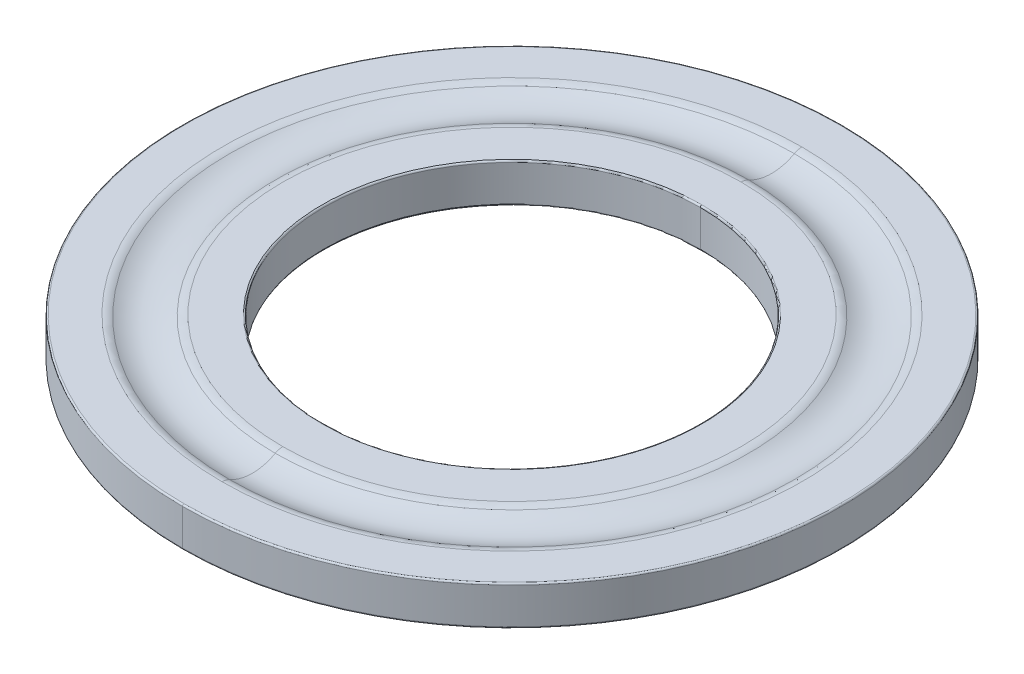
ISO-10303-21;
HEADER;
FILE_DESCRIPTION(('STEP AP214'),'2;1');
FILE_NAME('part.step','',(''),(''),'','','');
FILE_SCHEMA(('AUTOMOTIVE_DESIGN { 1 0 10303 214 1 1 1 1 }'));
ENDSEC;
DATA;
#1=APPLICATION_CONTEXT('core data for automotive mechanical design processes');
#2=APPLICATION_PROTOCOL_DEFINITION('international standard','automotive_design',2000,#1);
#3=PRODUCT_CONTEXT('',#1,'mechanical');
#4=PRODUCT('Part','Part','',(#3));
#5=PRODUCT_RELATED_PRODUCT_CATEGORY('part','',(#4));
#6=PRODUCT_DEFINITION_FORMATION('','',#4);
#7=PRODUCT_DEFINITION_CONTEXT('part definition',#1,'design');
#8=PRODUCT_DEFINITION('design','',#6,#7);
#9=PRODUCT_DEFINITION_SHAPE('','',#8);
#10=(LENGTH_UNIT() NAMED_UNIT(*) SI_UNIT(.MILLI.,.METRE.));
#11=(NAMED_UNIT(*) PLANE_ANGLE_UNIT() SI_UNIT($,.RADIAN.));
#12=(NAMED_UNIT(*) SI_UNIT($,.STERADIAN.) SOLID_ANGLE_UNIT());
#13=UNCERTAINTY_MEASURE_WITH_UNIT(LENGTH_MEASURE(1.E-05),#10,'distance_accuracy_value','');
#14=(GEOMETRIC_REPRESENTATION_CONTEXT(3) GLOBAL_UNCERTAINTY_ASSIGNED_CONTEXT((#13)) GLOBAL_UNIT_ASSIGNED_CONTEXT((#10,
#11,#12)) REPRESENTATION_CONTEXT('',''));
#15=CARTESIAN_POINT('',(0.,0.,0.));
#16=DIRECTION('',(0.,0.,1.));
#17=DIRECTION('',(1.,0.,0.));
#18=AXIS2_PLACEMENT_3D('',#15,#16,#17);
#19=CARTESIAN_POINT('',(0.,1.2,0.));
#20=DIRECTION('',(0.,1.,0.));
#21=DIRECTION('',(0.,0.,1.));
#22=AXIS2_PLACEMENT_3D('',#19,#20,#21);
#23=TOROIDAL_SURFACE('',#22,10.45,0.05);
#24=CARTESIAN_POINT('',(0.,1.2,-10.45));
#25=DIRECTION('',(1.,0.,0.));
#26=DIRECTION('',(0.,0.,-1.));
#27=AXIS2_PLACEMENT_3D('',#24,#25,#26);
#28=CIRCLE('',#27,0.05);
#29=CARTESIAN_POINT('',(0.,1.2,-10.5));
#30=VERTEX_POINT('',#29);
#31=CARTESIAN_POINT('',(0.,1.25,-10.45));
#32=VERTEX_POINT('',#31);
#33=EDGE_CURVE('E165',#30,#32,#28,.T.);
#34=ORIENTED_EDGE('',*,*,#33,.F.);
#35=CARTESIAN_POINT('',(0.,1.2,0.));
#36=DIRECTION('',(0.,-1.,0.));
#37=DIRECTION('',(0.,0.,1.));
#38=AXIS2_PLACEMENT_3D('',#35,#36,#37);
#39=CIRCLE('',#38,10.5);
#40=CARTESIAN_POINT('',(0.,1.2,10.5));
#41=VERTEX_POINT('',#40);
#42=EDGE_CURVE('E20',#41,#30,#39,.T.);
#43=ORIENTED_EDGE('',*,*,#42,.F.);
#44=CARTESIAN_POINT('',(0.,1.2,10.45));
#45=DIRECTION('',(-1.,0.,0.));
#46=DIRECTION('',(0.,0.,1.));
#47=AXIS2_PLACEMENT_3D('',#44,#45,#46);
#48=CIRCLE('',#47,0.05);
#49=CARTESIAN_POINT('',(0.,1.25,10.45));
#50=VERTEX_POINT('',#49);
#51=EDGE_CURVE('E173',#41,#50,#48,.T.);
#52=ORIENTED_EDGE('',*,*,#51,.T.);
#53=CARTESIAN_POINT('',(0.,1.25,0.));
#54=DIRECTION('',(0.,1.,0.));
#55=DIRECTION('',(0.,0.,1.));
#56=AXIS2_PLACEMENT_3D('',#53,#54,#55);
#57=CIRCLE('',#56,10.45);
#58=EDGE_CURVE('E162',#32,#50,#57,.T.);
#59=ORIENTED_EDGE('',*,*,#58,.F.);
#60=EDGE_LOOP('',(#34,#43,#52,#59));
#61=FACE_BOUND('',#60,.T.);
#62=ADVANCED_FACE('F17',(#61),#23,.T.);
#63=CARTESIAN_POINT('',(0.,0.05,0.));
#64=DIRECTION('',(0.,1.,0.));
#65=DIRECTION('',(0.,0.,1.));
#66=AXIS2_PLACEMENT_3D('',#63,#64,#65);
#67=TOROIDAL_SURFACE('',#66,10.45,0.05);
#68=CARTESIAN_POINT('',(0.,0.05,-10.45));
#69=DIRECTION('',(1.,0.,0.));
#70=DIRECTION('',(0.,0.,-1.));
#71=AXIS2_PLACEMENT_3D('',#68,#69,#70);
#72=CIRCLE('',#71,0.05);
#73=CARTESIAN_POINT('',(0.,0.,-10.45));
#74=VERTEX_POINT('',#73);
#75=CARTESIAN_POINT('',(0.,0.05,-10.5));
#76=VERTEX_POINT('',#75);
#77=EDGE_CURVE('E194',#74,#76,#72,.T.);
#78=ORIENTED_EDGE('',*,*,#77,.F.);
#79=CARTESIAN_POINT('',(0.,0.,0.));
#80=DIRECTION('',(0.,-1.,0.));
#81=DIRECTION('',(0.,0.,1.));
#82=AXIS2_PLACEMENT_3D('',#79,#80,#81);
#83=CIRCLE('',#82,10.45);
#84=CARTESIAN_POINT('',(0.,0.,10.45));
#85=VERTEX_POINT('',#84);
#86=EDGE_CURVE('E296',#85,#74,#83,.T.);
#87=ORIENTED_EDGE('',*,*,#86,.F.);
#88=CARTESIAN_POINT('',(0.,0.05,10.45));
#89=DIRECTION('',(-1.,0.,0.));
#90=DIRECTION('',(0.,0.,1.));
#91=AXIS2_PLACEMENT_3D('',#88,#89,#90);
#92=CIRCLE('',#91,0.05);
#93=CARTESIAN_POINT('',(0.,0.05,10.5));
#94=VERTEX_POINT('',#93);
#95=EDGE_CURVE('E193',#85,#94,#92,.T.);
#96=ORIENTED_EDGE('',*,*,#95,.T.);
#97=CARTESIAN_POINT('',(0.,0.05,0.));
#98=DIRECTION('',(0.,1.,0.));
#99=DIRECTION('',(0.,0.,1.));
#100=AXIS2_PLACEMENT_3D('',#97,#98,#99);
#101=CIRCLE('',#100,10.5);
#102=EDGE_CURVE('E11',#76,#94,#101,.T.);
#103=ORIENTED_EDGE('',*,*,#102,.F.);
#104=EDGE_LOOP('',(#78,#87,#96,#103));
#105=FACE_BOUND('',#104,.T.);
#106=ADVANCED_FACE('F360',(#105),#67,.T.);
#107=CARTESIAN_POINT('',(0.,1.2,0.));
#108=DIRECTION('',(0.,1.,0.));
#109=DIRECTION('',(0.,0.,1.));
#110=AXIS2_PLACEMENT_3D('',#107,#108,#109);
#111=TOROIDAL_SURFACE('',#110,6.05,0.05);
#112=CARTESIAN_POINT('',(0.,1.2,-6.05));
#113=DIRECTION('',(1.,0.,0.));
#114=DIRECTION('',(0.,0.,-1.));
#115=AXIS2_PLACEMENT_3D('',#112,#113,#114);
#116=CIRCLE('',#115,0.05);
#117=CARTESIAN_POINT('',(0.,1.25,-6.05));
#118=VERTEX_POINT('',#117);
#119=CARTESIAN_POINT('',(0.,1.2,-6.));
#120=VERTEX_POINT('',#119);
#121=EDGE_CURVE('E232',#118,#120,#116,.T.);
#122=ORIENTED_EDGE('',*,*,#121,.F.);
#123=CARTESIAN_POINT('',(0.,1.25,0.));
#124=DIRECTION('',(0.,-1.,0.));
#125=DIRECTION('',(0.,0.,1.));
#126=AXIS2_PLACEMENT_3D('',#123,#124,#125);
#127=CIRCLE('',#126,6.05);
#128=CARTESIAN_POINT('',(0.,1.25,6.05));
#129=VERTEX_POINT('',#128);
#130=EDGE_CURVE('E293',#129,#118,#127,.T.);
#131=ORIENTED_EDGE('',*,*,#130,.F.);
#132=CARTESIAN_POINT('',(0.,1.2,6.05));
#133=DIRECTION('',(-1.,0.,0.));
#134=DIRECTION('',(0.,0.,1.));
#135=AXIS2_PLACEMENT_3D('',#132,#133,#134);
#136=CIRCLE('',#135,0.05);
#137=CARTESIAN_POINT('',(0.,1.2,6.));
#138=VERTEX_POINT('',#137);
#139=EDGE_CURVE('E221',#129,#138,#136,.T.);
#140=ORIENTED_EDGE('',*,*,#139,.T.);
#141=CARTESIAN_POINT('',(0.,1.2,0.));
#142=DIRECTION('',(0.,1.,0.));
#143=DIRECTION('',(0.,0.,1.));
#144=AXIS2_PLACEMENT_3D('',#141,#142,#143);
#145=CIRCLE('',#144,6.);
#146=EDGE_CURVE('E189',#120,#138,#145,.T.);
#147=ORIENTED_EDGE('',*,*,#146,.F.);
#148=EDGE_LOOP('',(#122,#131,#140,#147));
#149=FACE_BOUND('',#148,.T.);
#150=ADVANCED_FACE('F320',(#149),#111,.T.);
#151=CARTESIAN_POINT('',(0.,0.05,0.));
#152=DIRECTION('',(0.,1.,0.));
#153=DIRECTION('',(0.,0.,1.));
#154=AXIS2_PLACEMENT_3D('',#151,#152,#153);
#155=TOROIDAL_SURFACE('',#154,6.05,0.05);
#156=CARTESIAN_POINT('',(0.,0.05,-6.05));
#157=DIRECTION('',(1.,0.,0.));
#158=DIRECTION('',(0.,0.,-1.));
#159=AXIS2_PLACEMENT_3D('',#156,#157,#158);
#160=CIRCLE('',#159,0.05);
#161=CARTESIAN_POINT('',(0.,0.05,-6.));
#162=VERTEX_POINT('',#161);
#163=CARTESIAN_POINT('',(0.,0.,-6.05));
#164=VERTEX_POINT('',#163);
#165=EDGE_CURVE('E184',#162,#164,#160,.T.);
#166=ORIENTED_EDGE('',*,*,#165,.F.);
#167=CARTESIAN_POINT('',(0.,0.05,0.));
#168=DIRECTION('',(0.,-1.,0.));
#169=DIRECTION('',(0.,0.,1.));
#170=AXIS2_PLACEMENT_3D('',#167,#168,#169);
#171=CIRCLE('',#170,6.);
#172=CARTESIAN_POINT('',(0.,0.05,6.));
#173=VERTEX_POINT('',#172);
#174=EDGE_CURVE('E188',#173,#162,#171,.T.);
#175=ORIENTED_EDGE('',*,*,#174,.F.);
#176=CARTESIAN_POINT('',(0.,0.05,6.05));
#177=DIRECTION('',(-1.,0.,0.));
#178=DIRECTION('',(0.,0.,1.));
#179=AXIS2_PLACEMENT_3D('',#176,#177,#178);
#180=CIRCLE('',#179,0.05);
#181=CARTESIAN_POINT('',(0.,0.,6.05));
#182=VERTEX_POINT('',#181);
#183=EDGE_CURVE('E183',#173,#182,#180,.T.);
#184=ORIENTED_EDGE('',*,*,#183,.T.);
#185=CARTESIAN_POINT('',(0.,0.,0.));
#186=DIRECTION('',(0.,1.,0.));
#187=DIRECTION('',(0.,0.,1.));
#188=AXIS2_PLACEMENT_3D('',#185,#186,#187);
#189=CIRCLE('',#188,6.05);
#190=EDGE_CURVE('E152',#164,#182,#189,.T.);
#191=ORIENTED_EDGE('',*,*,#190,.F.);
#192=EDGE_LOOP('',(#166,#175,#184,#191));
#193=FACE_BOUND('',#192,.T.);
#194=ADVANCED_FACE('F307',(#193),#155,.T.);
#195=CARTESIAN_POINT('',(0.,0.75,0.));
#196=DIRECTION('',(0.,1.,0.));
#197=DIRECTION('',(0.,0.,1.));
#198=AXIS2_PLACEMENT_3D('',#195,#196,#197);
#199=TOROIDAL_SURFACE('',#198,9.23824583655185,0.5);
#200=CARTESIAN_POINT('',(0.,0.75,-9.23824583655185));
#201=DIRECTION('',(1.,0.,0.));
#202=DIRECTION('',(0.,0.,-1.));
#203=AXIS2_PLACEMENT_3D('',#200,#201,#202);
#204=CIRCLE('',#203,0.5);
#205=CARTESIAN_POINT('',(0.,1.25,-9.23824583655185));
#206=VERTEX_POINT('',#205);
#207=CARTESIAN_POINT('',(0.,1.18749999999994,-8.99618437741385));
#208=VERTEX_POINT('',#207);
#209=EDGE_CURVE('E209',#206,#208,#204,.T.);
#210=ORIENTED_EDGE('',*,*,#209,.F.);
#211=CARTESIAN_POINT('',(0.,1.25,0.));
#212=DIRECTION('',(0.,-1.,0.));
#213=DIRECTION('',(0.,0.,1.));
#214=AXIS2_PLACEMENT_3D('',#211,#212,#213);
#215=CIRCLE('',#214,9.23824583655185);
#216=CARTESIAN_POINT('',(0.,1.25,9.23824583655185));
#217=VERTEX_POINT('',#216);
#218=EDGE_CURVE('E220',#217,#206,#215,.T.);
#219=ORIENTED_EDGE('',*,*,#218,.F.);
#220=CARTESIAN_POINT('',(0.,0.75,9.23824583655185));
#221=DIRECTION('',(-1.,0.,0.));
#222=DIRECTION('',(0.,0.,1.));
#223=AXIS2_PLACEMENT_3D('',#220,#221,#222);
#224=CIRCLE('',#223,0.5);
#225=CARTESIAN_POINT('',(0.,1.18749999999994,8.99618437741385));
#226=VERTEX_POINT('',#225);
#227=EDGE_CURVE('E249',#217,#226,#224,.T.);
#228=ORIENTED_EDGE('',*,*,#227,.T.);
#229=CARTESIAN_POINT('',(0.,1.18749999999994,0.));
#230=DIRECTION('',(0.,1.,0.));
#231=DIRECTION('',(0.,0.,1.));
#232=AXIS2_PLACEMENT_3D('',#229,#230,#231);
#233=CIRCLE('',#232,8.99618437741392);
#234=EDGE_CURVE('E266',#208,#226,#233,.T.);
#235=ORIENTED_EDGE('',*,*,#234,.F.);
#236=EDGE_LOOP('',(#210,#219,#228,#235));
#237=FACE_BOUND('',#236,.T.);
#238=ADVANCED_FACE('F344',(#237),#199,.T.);
#239=CARTESIAN_POINT('',(0.,0.75,0.));
#240=DIRECTION('',(0.,-1.,0.));
#241=DIRECTION('',(0.,0.,-1.));
#242=AXIS2_PLACEMENT_3D('',#239,#240,#241);
#243=TOROIDAL_SURFACE('',#242,7.30175416344815,0.5);
#244=CARTESIAN_POINT('',(0.,0.75,7.30175416344815));
#245=DIRECTION('',(1.,0.,0.));
#246=DIRECTION('',(0.,0.,-1.));
#247=AXIS2_PLACEMENT_3D('',#244,#245,#246);
#248=CIRCLE('',#247,0.5);
#249=CARTESIAN_POINT('',(0.,1.25,7.30175416344815));
#250=VERTEX_POINT('',#249);
#251=CARTESIAN_POINT('',(0.,1.18749999999996,7.54381562258609));
#252=VERTEX_POINT('',#251);
#253=EDGE_CURVE('E208',#250,#252,#248,.T.);
#254=ORIENTED_EDGE('',*,*,#253,.F.);
#255=CARTESIAN_POINT('',(0.,1.25,0.));
#256=DIRECTION('',(0.,1.,0.));
#257=DIRECTION('',(0.,0.,1.));
#258=AXIS2_PLACEMENT_3D('',#255,#256,#257);
#259=CIRCLE('',#258,7.30175416344815);
#260=CARTESIAN_POINT('',(0.,1.25,-7.30175416344815));
#261=VERTEX_POINT('',#260);
#262=EDGE_CURVE('E290',#261,#250,#259,.T.);
#263=ORIENTED_EDGE('',*,*,#262,.F.);
#264=CARTESIAN_POINT('',(0.,0.75,-7.30175416344815));
#265=DIRECTION('',(-1.,0.,0.));
#266=DIRECTION('',(0.,0.,1.));
#267=AXIS2_PLACEMENT_3D('',#264,#265,#266);
#268=CIRCLE('',#267,0.5);
#269=CARTESIAN_POINT('',(0.,1.18749999999996,-7.54381562258609));
#270=VERTEX_POINT('',#269);
#271=EDGE_CURVE('E207',#261,#270,#268,.T.);
#272=ORIENTED_EDGE('',*,*,#271,.T.);
#273=CARTESIAN_POINT('',(0.,1.18749999999996,0.));
#274=DIRECTION('',(0.,-1.,0.));
#275=DIRECTION('',(0.,0.,1.));
#276=AXIS2_PLACEMENT_3D('',#273,#274,#275);
#277=CIRCLE('',#276,7.54381562258609);
#278=EDGE_CURVE('E49',#252,#270,#277,.T.);
#279=ORIENTED_EDGE('',*,*,#278,.F.);
#280=EDGE_LOOP('',(#254,#263,#272,#279));
#281=FACE_BOUND('',#280,.T.);
#282=ADVANCED_FACE('F332',(#281),#243,.T.);
#283=CARTESIAN_POINT('',(0.,2.5,0.));
#284=DIRECTION('',(0.,-1.,0.));
#285=DIRECTION('',(0.,0.,-1.));
#286=AXIS2_PLACEMENT_3D('',#283,#284,#285);
#287=TOROIDAL_SURFACE('',#286,8.27,1.5);
#288=CARTESIAN_POINT('',(0.,2.5,8.27));
#289=DIRECTION('',(1.,0.,0.));
#290=DIRECTION('',(0.,0.,-1.));
#291=AXIS2_PLACEMENT_3D('',#288,#289,#290);
#292=CIRCLE('',#291,1.5);
#293=EDGE_CURVE('E270',#226,#252,#292,.T.);
#294=ORIENTED_EDGE('',*,*,#293,.F.);
#295=CARTESIAN_POINT('',(0.,1.18749999999994,0.));
#296=DIRECTION('',(0.,1.,0.));
#297=DIRECTION('',(0.,0.,1.));
#298=AXIS2_PLACEMENT_3D('',#295,#296,#297);
#299=CIRCLE('',#298,8.99618437741392);
#300=EDGE_CURVE('E213',#226,#208,#299,.T.);
#301=ORIENTED_EDGE('',*,*,#300,.T.);
#302=CARTESIAN_POINT('',(0.,2.5,-8.27));
#303=DIRECTION('',(-1.,0.,0.));
#304=DIRECTION('',(0.,0.,1.));
#305=AXIS2_PLACEMENT_3D('',#302,#303,#304);
#306=CIRCLE('',#305,1.5);
#307=EDGE_CURVE('E39',#208,#270,#306,.T.);
#308=ORIENTED_EDGE('',*,*,#307,.T.);
#309=CARTESIAN_POINT('',(0.,1.18749999999996,0.));
#310=DIRECTION('',(0.,-1.,0.));
#311=DIRECTION('',(0.,0.,1.));
#312=AXIS2_PLACEMENT_3D('',#309,#310,#311);
#313=CIRCLE('',#312,7.54381562258609);
#314=EDGE_CURVE('E204',#270,#252,#313,.T.);
#315=ORIENTED_EDGE('',*,*,#314,.T.);
#316=EDGE_LOOP('',(#294,#301,#308,#315));
#317=FACE_BOUND('',#316,.T.);
#318=ADVANCED_FACE('F336',(#317),#287,.F.);
#319=CARTESIAN_POINT('',(0.,1.25,0.));
#320=DIRECTION('',(0.,-1.,0.));
#321=DIRECTION('',(0.,0.,-1.));
#322=AXIS2_PLACEMENT_3D('',#319,#320,#321);
#323=CYLINDRICAL_SURFACE('',#322,6.);
#324=DIRECTION('',(0.,-1.,0.));
#325=VECTOR('',#324,1.);
#326=CARTESIAN_POINT('',(0.,1.25,6.));
#327=LINE('',#326,#325);
#328=EDGE_CURVE('E185',#138,#173,#327,.T.);
#329=ORIENTED_EDGE('',*,*,#328,.F.);
#330=CARTESIAN_POINT('',(0.,1.2,0.));
#331=DIRECTION('',(0.,1.,0.));
#332=DIRECTION('',(0.,0.,1.));
#333=AXIS2_PLACEMENT_3D('',#330,#331,#332);
#334=CIRCLE('',#333,6.);
#335=EDGE_CURVE('E226',#138,#120,#334,.T.);
#336=ORIENTED_EDGE('',*,*,#335,.T.);
#337=DIRECTION('',(0.,-1.,0.));
#338=VECTOR('',#337,1.);
#339=CARTESIAN_POINT('',(0.,1.25,-6.));
#340=LINE('',#339,#338);
#341=EDGE_CURVE('E277',#120,#162,#340,.T.);
#342=ORIENTED_EDGE('',*,*,#341,.T.);
#343=CARTESIAN_POINT('',(0.,0.05,0.));
#344=DIRECTION('',(0.,-1.,0.));
#345=DIRECTION('',(0.,0.,1.));
#346=AXIS2_PLACEMENT_3D('',#343,#344,#345);
#347=CIRCLE('',#346,6.);
#348=EDGE_CURVE('E225',#162,#173,#347,.T.);
#349=ORIENTED_EDGE('',*,*,#348,.T.);
#350=EDGE_LOOP('',(#329,#336,#342,#349));
#351=FACE_BOUND('',#350,.T.);
#352=ADVANCED_FACE('F312',(#351),#323,.F.);
#353=CARTESIAN_POINT('',(0.,1.25,0.));
#354=DIRECTION('',(0.,-1.,0.));
#355=DIRECTION('',(0.,0.,-1.));
#356=AXIS2_PLACEMENT_3D('',#353,#354,#355);
#357=CYLINDRICAL_SURFACE('',#356,10.5);
#358=DIRECTION('',(0.,-1.,0.));
#359=VECTOR('',#358,1.);
#360=CARTESIAN_POINT('',(0.,1.25,10.5));
#361=LINE('',#360,#359);
#362=EDGE_CURVE('E146',#41,#94,#361,.T.);
#363=ORIENTED_EDGE('',*,*,#362,.F.);
#364=ORIENTED_EDGE('',*,*,#42,.T.);
#365=DIRECTION('',(0.,-1.,0.));
#366=VECTOR('',#365,1.);
#367=CARTESIAN_POINT('',(0.,1.25,-10.5));
#368=LINE('',#367,#366);
#369=EDGE_CURVE('E143',#30,#76,#368,.T.);
#370=ORIENTED_EDGE('',*,*,#369,.T.);
#371=ORIENTED_EDGE('',*,*,#102,.T.);
#372=EDGE_LOOP('',(#363,#364,#370,#371));
#373=FACE_BOUND('',#372,.T.);
#374=ADVANCED_FACE('F142',(#373),#357,.T.);
#375=CARTESIAN_POINT('',(0.,0.,0.));
#376=DIRECTION('',(0.,1.,0.));
#377=DIRECTION('',(1.,0.,0.));
#378=AXIS2_PLACEMENT_3D('',#375,#376,#377);
#379=PLANE('',#378);
#380=CARTESIAN_POINT('',(0.,0.,0.));
#381=DIRECTION('',(0.,1.,0.));
#382=DIRECTION('',(0.,0.,1.));
#383=AXIS2_PLACEMENT_3D('',#380,#381,#382);
#384=CIRCLE('',#383,6.05);
#385=EDGE_CURVE('E179',#182,#164,#384,.T.);
#386=ORIENTED_EDGE('',*,*,#385,.T.);
#387=ORIENTED_EDGE('',*,*,#190,.T.);
#388=EDGE_LOOP('',(#386,#387));
#389=FACE_BOUND('',#388,.T.);
#390=ORIENTED_EDGE('',*,*,#86,.T.);
#391=CARTESIAN_POINT('',(0.,0.,0.));
#392=DIRECTION('',(0.,-1.,0.));
#393=DIRECTION('',(0.,0.,1.));
#394=AXIS2_PLACEMENT_3D('',#391,#392,#393);
#395=CIRCLE('',#394,10.45);
#396=EDGE_CURVE('E203',#74,#85,#395,.T.);
#397=ORIENTED_EDGE('',*,*,#396,.T.);
#398=EDGE_LOOP('',(#390,#397));
#399=FACE_BOUND('',#398,.T.);
#400=ADVANCED_FACE('F301',(#389,#399),#379,.F.);
#401=CARTESIAN_POINT('',(0.,1.25,0.));
#402=DIRECTION('',(0.,1.,0.));
#403=DIRECTION('',(1.,0.,0.));
#404=AXIS2_PLACEMENT_3D('',#401,#402,#403);
#405=PLANE('',#404);
#406=ORIENTED_EDGE('',*,*,#130,.T.);
#407=CARTESIAN_POINT('',(0.,1.25,0.));
#408=DIRECTION('',(0.,-1.,0.));
#409=DIRECTION('',(0.,0.,1.));
#410=AXIS2_PLACEMENT_3D('',#407,#408,#409);
#411=CIRCLE('',#410,6.05);
#412=EDGE_CURVE('E198',#118,#129,#411,.T.);
#413=ORIENTED_EDGE('',*,*,#412,.T.);
#414=EDGE_LOOP('',(#406,#413));
#415=FACE_BOUND('',#414,.T.);
#416=ORIENTED_EDGE('',*,*,#262,.T.);
#417=CARTESIAN_POINT('',(0.,1.25,0.));
#418=DIRECTION('',(0.,1.,0.));
#419=DIRECTION('',(0.,0.,1.));
#420=AXIS2_PLACEMENT_3D('',#417,#418,#419);
#421=CIRCLE('',#420,7.30175416344815);
#422=EDGE_CURVE('E245',#250,#261,#421,.T.);
#423=ORIENTED_EDGE('',*,*,#422,.T.);
#424=EDGE_LOOP('',(#416,#423));
#425=FACE_BOUND('',#424,.T.);
#426=ADVANCED_FACE('F325',(#415,#425),#405,.T.);
#427=CARTESIAN_POINT('',(0.,1.25,0.));
#428=DIRECTION('',(0.,1.,0.));
#429=DIRECTION('',(1.,0.,0.));
#430=AXIS2_PLACEMENT_3D('',#427,#428,#429);
#431=PLANE('',#430);
#432=ORIENTED_EDGE('',*,*,#218,.T.);
#433=CARTESIAN_POINT('',(0.,1.25,0.));
#434=DIRECTION('',(0.,-1.,0.));
#435=DIRECTION('',(0.,0.,1.));
#436=AXIS2_PLACEMENT_3D('',#433,#434,#435);
#437=CIRCLE('',#436,9.23824583655185);
#438=EDGE_CURVE('E214',#206,#217,#437,.T.);
#439=ORIENTED_EDGE('',*,*,#438,.T.);
#440=EDGE_LOOP('',(#432,#439));
#441=FACE_BOUND('',#440,.T.);
#442=CARTESIAN_POINT('',(0.,1.25,0.));
#443=DIRECTION('',(0.,1.,0.));
#444=DIRECTION('',(0.,0.,1.));
#445=AXIS2_PLACEMENT_3D('',#442,#443,#444);
#446=CIRCLE('',#445,10.45);
#447=EDGE_CURVE('E170',#50,#32,#446,.T.);
#448=ORIENTED_EDGE('',*,*,#447,.T.);
#449=ORIENTED_EDGE('',*,*,#58,.T.);
#450=EDGE_LOOP('',(#448,#449));
#451=FACE_BOUND('',#450,.T.);
#452=ADVANCED_FACE('F328',(#441,#451),#431,.T.);
#453=CARTESIAN_POINT('',(0.,1.25,0.));
#454=DIRECTION('',(0.,-1.,0.));
#455=DIRECTION('',(0.,0.,-1.));
#456=AXIS2_PLACEMENT_3D('',#453,#454,#455);
#457=CYLINDRICAL_SURFACE('',#456,10.5);
#458=CARTESIAN_POINT('',(0.,1.2,0.));
#459=DIRECTION('',(0.,-1.,0.));
#460=DIRECTION('',(0.,0.,1.));
#461=AXIS2_PLACEMENT_3D('',#458,#459,#460);
#462=CIRCLE('',#461,10.5);
#463=EDGE_CURVE('E157',#30,#41,#462,.T.);
#464=ORIENTED_EDGE('',*,*,#463,.T.);
#465=ORIENTED_EDGE('',*,*,#362,.T.);
#466=CARTESIAN_POINT('',(0.,0.05,0.));
#467=DIRECTION('',(0.,1.,0.));
#468=DIRECTION('',(0.,0.,1.));
#469=AXIS2_PLACEMENT_3D('',#466,#467,#468);
#470=CIRCLE('',#469,10.5);
#471=EDGE_CURVE('E159',#94,#76,#470,.T.);
#472=ORIENTED_EDGE('',*,*,#471,.T.);
#473=ORIENTED_EDGE('',*,*,#369,.F.);
#474=EDGE_LOOP('',(#464,#465,#472,#473));
#475=FACE_BOUND('',#474,.T.);
#476=ADVANCED_FACE('F155',(#475),#457,.T.);
#477=CARTESIAN_POINT('',(0.,1.25,0.));
#478=DIRECTION('',(0.,-1.,0.));
#479=DIRECTION('',(0.,0.,-1.));
#480=AXIS2_PLACEMENT_3D('',#477,#478,#479);
#481=CYLINDRICAL_SURFACE('',#480,6.);
#482=ORIENTED_EDGE('',*,*,#146,.T.);
#483=ORIENTED_EDGE('',*,*,#328,.T.);
#484=ORIENTED_EDGE('',*,*,#174,.T.);
#485=ORIENTED_EDGE('',*,*,#341,.F.);
#486=EDGE_LOOP('',(#482,#483,#484,#485));
#487=FACE_BOUND('',#486,.T.);
#488=ADVANCED_FACE('F316',(#487),#481,.F.);
#489=CARTESIAN_POINT('',(0.,2.5,0.));
#490=DIRECTION('',(0.,-1.,0.));
#491=DIRECTION('',(0.,0.,-1.));
#492=AXIS2_PLACEMENT_3D('',#489,#490,#491);
#493=TOROIDAL_SURFACE('',#492,8.27,1.5);
#494=ORIENTED_EDGE('',*,*,#234,.T.);
#495=ORIENTED_EDGE('',*,*,#293,.T.);
#496=ORIENTED_EDGE('',*,*,#278,.T.);
#497=ORIENTED_EDGE('',*,*,#307,.F.);
#498=EDGE_LOOP('',(#494,#495,#496,#497));
#499=FACE_BOUND('',#498,.T.);
#500=ADVANCED_FACE('F340',(#499),#493,.F.);
#501=CARTESIAN_POINT('',(0.,0.75,0.));
#502=DIRECTION('',(0.,-1.,0.));
#503=DIRECTION('',(0.,0.,-1.));
#504=AXIS2_PLACEMENT_3D('',#501,#502,#503);
#505=TOROIDAL_SURFACE('',#504,7.30175416344815,0.5);
#506=ORIENTED_EDGE('',*,*,#422,.F.);
#507=ORIENTED_EDGE('',*,*,#253,.T.);
#508=ORIENTED_EDGE('',*,*,#314,.F.);
#509=ORIENTED_EDGE('',*,*,#271,.F.);
#510=EDGE_LOOP('',(#506,#507,#508,#509));
#511=FACE_BOUND('',#510,.T.);
#512=ADVANCED_FACE('F335',(#511),#505,.T.);
#513=CARTESIAN_POINT('',(0.,0.75,0.));
#514=DIRECTION('',(0.,1.,0.));
#515=DIRECTION('',(0.,0.,1.));
#516=AXIS2_PLACEMENT_3D('',#513,#514,#515);
#517=TOROIDAL_SURFACE('',#516,9.23824583655185,0.5);
#518=ORIENTED_EDGE('',*,*,#438,.F.);
#519=ORIENTED_EDGE('',*,*,#209,.T.);
#520=ORIENTED_EDGE('',*,*,#300,.F.);
#521=ORIENTED_EDGE('',*,*,#227,.F.);
#522=EDGE_LOOP('',(#518,#519,#520,#521));
#523=FACE_BOUND('',#522,.T.);
#524=ADVANCED_FACE('F347',(#523),#517,.T.);
#525=CARTESIAN_POINT('',(0.,0.05,0.));
#526=DIRECTION('',(0.,1.,0.));
#527=DIRECTION('',(0.,0.,1.));
#528=AXIS2_PLACEMENT_3D('',#525,#526,#527);
#529=TOROIDAL_SURFACE('',#528,6.05,0.05);
#530=ORIENTED_EDGE('',*,*,#348,.F.);
#531=ORIENTED_EDGE('',*,*,#165,.T.);
#532=ORIENTED_EDGE('',*,*,#385,.F.);
#533=ORIENTED_EDGE('',*,*,#183,.F.);
#534=EDGE_LOOP('',(#530,#531,#532,#533));
#535=FACE_BOUND('',#534,.T.);
#536=ADVANCED_FACE('F310',(#535),#529,.T.);
#537=CARTESIAN_POINT('',(0.,1.2,0.));
#538=DIRECTION('',(0.,1.,0.));
#539=DIRECTION('',(0.,0.,1.));
#540=AXIS2_PLACEMENT_3D('',#537,#538,#539);
#541=TOROIDAL_SURFACE('',#540,6.05,0.05);
#542=ORIENTED_EDGE('',*,*,#412,.F.);
#543=ORIENTED_EDGE('',*,*,#121,.T.);
#544=ORIENTED_EDGE('',*,*,#335,.F.);
#545=ORIENTED_EDGE('',*,*,#139,.F.);
#546=EDGE_LOOP('',(#542,#543,#544,#545));
#547=FACE_BOUND('',#546,.T.);
#548=ADVANCED_FACE('F323',(#547),#541,.T.);
#549=CARTESIAN_POINT('',(0.,0.05,0.));
#550=DIRECTION('',(0.,1.,0.));
#551=DIRECTION('',(0.,0.,1.));
#552=AXIS2_PLACEMENT_3D('',#549,#550,#551);
#553=TOROIDAL_SURFACE('',#552,10.45,0.05);
#554=ORIENTED_EDGE('',*,*,#396,.F.);
#555=ORIENTED_EDGE('',*,*,#77,.T.);
#556=ORIENTED_EDGE('',*,*,#471,.F.);
#557=ORIENTED_EDGE('',*,*,#95,.F.);
#558=EDGE_LOOP('',(#554,#555,#556,#557));
#559=FACE_BOUND('',#558,.T.);
#560=ADVANCED_FACE('F462',(#559),#553,.T.);
#561=CARTESIAN_POINT('',(0.,1.2,0.));
#562=DIRECTION('',(0.,1.,0.));
#563=DIRECTION('',(0.,0.,1.));
#564=AXIS2_PLACEMENT_3D('',#561,#562,#563);
#565=TOROIDAL_SURFACE('',#564,10.45,0.05);
#566=ORIENTED_EDGE('',*,*,#463,.F.);
#567=ORIENTED_EDGE('',*,*,#33,.T.);
#568=ORIENTED_EDGE('',*,*,#447,.F.);
#569=ORIENTED_EDGE('',*,*,#51,.F.);
#570=EDGE_LOOP('',(#566,#567,#568,#569));
#571=FACE_BOUND('',#570,.T.);
#572=ADVANCED_FACE('F172',(#571),#565,.T.);
#573=CLOSED_SHELL('',(#62,#106,#150,#194,#238,#282,#318,#352,#374,#400,#426,#452,#476,#488,#500,
#512,#524,#536,#548,#560,#572));
#574=MANIFOLD_SOLID_BREP('B1',#573);
#575=ADVANCED_BREP_SHAPE_REPRESENTATION('',(#18,#574),#14);
#576=SHAPE_DEFINITION_REPRESENTATION(#9,#575);
ENDSEC;
END-ISO-10303-21;
